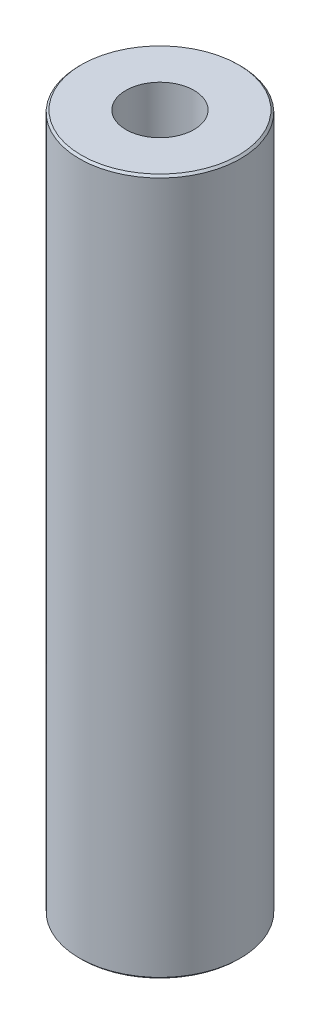
ISO-10303-21;
HEADER;
FILE_DESCRIPTION(('STEP AP214'),'2;1');
FILE_NAME('part.step','',(''),(''),'','','');
FILE_SCHEMA(('AUTOMOTIVE_DESIGN { 1 0 10303 214 1 1 1 1 }'));
ENDSEC;
DATA;
#1=APPLICATION_CONTEXT('core data for automotive mechanical design processes');
#2=APPLICATION_PROTOCOL_DEFINITION('international standard','automotive_design',2000,#1);
#3=PRODUCT_CONTEXT('',#1,'mechanical');
#4=PRODUCT('Part','Part','',(#3));
#5=PRODUCT_RELATED_PRODUCT_CATEGORY('part','',(#4));
#6=PRODUCT_DEFINITION_FORMATION('','',#4);
#7=PRODUCT_DEFINITION_CONTEXT('part definition',#1,'design');
#8=PRODUCT_DEFINITION('design','',#6,#7);
#9=PRODUCT_DEFINITION_SHAPE('','',#8);
#10=(LENGTH_UNIT() NAMED_UNIT(*) SI_UNIT(.MILLI.,.METRE.));
#11=(NAMED_UNIT(*) PLANE_ANGLE_UNIT() SI_UNIT($,.RADIAN.));
#12=(NAMED_UNIT(*) SI_UNIT($,.STERADIAN.) SOLID_ANGLE_UNIT());
#13=UNCERTAINTY_MEASURE_WITH_UNIT(LENGTH_MEASURE(1.E-05),#10,'distance_accuracy_value','');
#14=(GEOMETRIC_REPRESENTATION_CONTEXT(3) GLOBAL_UNCERTAINTY_ASSIGNED_CONTEXT((#13)) GLOBAL_UNIT_ASSIGNED_CONTEXT((#10,
#11,#12)) REPRESENTATION_CONTEXT('',''));
#15=CARTESIAN_POINT('',(0.,0.,0.));
#16=DIRECTION('',(0.,0.,1.));
#17=DIRECTION('',(1.,0.,0.));
#18=AXIS2_PLACEMENT_3D('',#15,#16,#17);
#19=CARTESIAN_POINT('',(0.,454.009973873022,0.));
#20=DIRECTION('',(0.,-1.,0.));
#21=DIRECTION('',(0.,0.,-1.));
#22=AXIS2_PLACEMENT_3D('',#19,#20,#21);
#23=CYLINDRICAL_SURFACE('',#22,52.5);
#24=CARTESIAN_POINT('',(0.,452.687352338189,0.));
#25=DIRECTION('',(0.,1.,0.));
#26=DIRECTION('',(0.,0.,1.));
#27=AXIS2_PLACEMENT_3D('',#24,#25,#26);
#28=CIRCLE('',#27,52.5);
#29=CARTESIAN_POINT('',(0.,452.687352338189,52.5));
#30=VERTEX_POINT('',#29);
#31=EDGE_CURVE('E50',#30,#30,#28,.F.);
#32=ORIENTED_EDGE('',*,*,#31,.T.);
#33=EDGE_LOOP('',(#32));
#34=FACE_BOUND('',#33,.T.);
#35=CARTESIAN_POINT('',(0.,1.32262153483309,0.));
#36=DIRECTION('',(0.,1.,0.));
#37=DIRECTION('',(0.,0.,1.));
#38=AXIS2_PLACEMENT_3D('',#35,#36,#37);
#39=CIRCLE('',#38,52.5);
#40=CARTESIAN_POINT('',(0.,1.32262153483309,52.5));
#41=VERTEX_POINT('',#40);
#42=EDGE_CURVE('E51',#41,#41,#39,.T.);
#43=ORIENTED_EDGE('',*,*,#42,.T.);
#44=EDGE_LOOP('',(#43));
#45=FACE_BOUND('',#44,.T.);
#46=ADVANCED_FACE('F39',(#34,#45),#23,.T.);
#47=CARTESIAN_POINT('',(0.,454.009973873022,0.));
#48=DIRECTION('',(0.,1.,0.));
#49=DIRECTION('',(0.,0.,1.));
#50=AXIS2_PLACEMENT_3D('',#47,#48,#49);
#51=PLANE('',#50);
#52=CARTESIAN_POINT('',(0.,454.009973873022,0.));
#53=DIRECTION('',(0.,1.,0.));
#54=DIRECTION('',(0.,0.,1.));
#55=AXIS2_PLACEMENT_3D('',#52,#53,#54);
#56=CIRCLE('',#55,51.1773784651669);
#57=CARTESIAN_POINT('',(0.,454.009973873022,51.1773784651669));
#58=VERTEX_POINT('',#57);
#59=EDGE_CURVE('E54',#58,#58,#56,.T.);
#60=ORIENTED_EDGE('',*,*,#59,.T.);
#61=EDGE_LOOP('',(#60));
#62=FACE_BOUND('',#61,.T.);
#63=CARTESIAN_POINT('',(0.,454.009973873022,0.));
#64=DIRECTION('',(0.,1.,0.));
#65=DIRECTION('',(0.,0.,1.));
#66=AXIS2_PLACEMENT_3D('',#63,#64,#65);
#67=CIRCLE('',#66,22.2014656765028);
#68=CARTESIAN_POINT('',(0.,454.009973873022,22.2014656765028));
#69=VERTEX_POINT('',#68);
#70=EDGE_CURVE('E58',#69,#69,#67,.T.);
#71=ORIENTED_EDGE('',*,*,#70,.F.);
#72=EDGE_LOOP('',(#71));
#73=FACE_BOUND('',#72,.T.);
#74=ADVANCED_FACE('F69',(#62,#73),#51,.T.);
#75=CARTESIAN_POINT('',(0.,0.,0.));
#76=DIRECTION('',(0.,1.,0.));
#77=DIRECTION('',(0.,0.,1.));
#78=AXIS2_PLACEMENT_3D('',#75,#76,#77);
#79=PLANE('',#78);
#80=CARTESIAN_POINT('',(0.,0.,0.));
#81=DIRECTION('',(0.,1.,0.));
#82=DIRECTION('',(0.,0.,1.));
#83=AXIS2_PLACEMENT_3D('',#80,#81,#82);
#84=CIRCLE('',#83,51.177378465167);
#85=CARTESIAN_POINT('',(0.,0.,51.177378465167));
#86=VERTEX_POINT('',#85);
#87=EDGE_CURVE('E10',#86,#86,#84,.F.);
#88=ORIENTED_EDGE('',*,*,#87,.T.);
#89=EDGE_LOOP('',(#88));
#90=FACE_BOUND('',#89,.T.);
#91=CARTESIAN_POINT('',(0.,0.,0.));
#92=DIRECTION('',(0.,1.,0.));
#93=DIRECTION('',(0.,0.,1.));
#94=AXIS2_PLACEMENT_3D('',#91,#92,#93);
#95=CIRCLE('',#94,22.2014656765028);
#96=CARTESIAN_POINT('',(0.,0.,22.2014656765028));
#97=VERTEX_POINT('',#96);
#98=EDGE_CURVE('E63',#97,#97,#95,.T.);
#99=ORIENTED_EDGE('',*,*,#98,.T.);
#100=EDGE_LOOP('',(#99));
#101=FACE_BOUND('',#100,.T.);
#102=ADVANCED_FACE('F75',(#90,#101),#79,.F.);
#103=CARTESIAN_POINT('',(0.,454.009973873022,0.));
#104=DIRECTION('',(0.,-1.,0.));
#105=DIRECTION('',(0.,0.,-1.));
#106=AXIS2_PLACEMENT_3D('',#103,#104,#105);
#107=CYLINDRICAL_SURFACE('',#106,22.2014656765028);
#108=ORIENTED_EDGE('',*,*,#70,.T.);
#109=EDGE_LOOP('',(#108));
#110=FACE_BOUND('',#109,.T.);
#111=ORIENTED_EDGE('',*,*,#98,.F.);
#112=EDGE_LOOP('',(#111));
#113=FACE_BOUND('',#112,.T.);
#114=ADVANCED_FACE('F70',(#110,#113),#107,.F.);
#115=CARTESIAN_POINT('',(0.,454.009973873022,0.));
#116=DIRECTION('',(0.,-1.,0.));
#117=DIRECTION('',(0.,0.,-1.));
#118=AXIS2_PLACEMENT_3D('',#115,#116,#117);
#119=CONICAL_SURFACE('',#118,51.1773784651669,0.785398163397409);
#120=ORIENTED_EDGE('',*,*,#31,.F.);
#121=EDGE_LOOP('',(#120));
#122=FACE_BOUND('',#121,.T.);
#123=ORIENTED_EDGE('',*,*,#59,.F.);
#124=EDGE_LOOP('',(#123));
#125=FACE_BOUND('',#124,.T.);
#126=ADVANCED_FACE('F81',(#122,#125),#119,.T.);
#127=CARTESIAN_POINT('',(0.,1.32262153483309,0.));
#128=DIRECTION('',(0.,1.,0.));
#129=DIRECTION('',(0.,0.,1.));
#130=AXIS2_PLACEMENT_3D('',#127,#128,#129);
#131=CONICAL_SURFACE('',#130,52.5,0.78539816339743);
#132=ORIENTED_EDGE('',*,*,#87,.F.);
#133=EDGE_LOOP('',(#132));
#134=FACE_BOUND('',#133,.T.);
#135=ORIENTED_EDGE('',*,*,#42,.F.);
#136=EDGE_LOOP('',(#135));
#137=FACE_BOUND('',#136,.T.);
#138=ADVANCED_FACE('F45',(#134,#137),#131,.T.);
#139=CLOSED_SHELL('',(#46,#74,#102,#114,#126,#138));
#140=MANIFOLD_SOLID_BREP('B2',#139);
#141=ADVANCED_BREP_SHAPE_REPRESENTATION('',(#18,#140),#14);
#142=SHAPE_DEFINITION_REPRESENTATION(#9,#141);
ENDSEC;
END-ISO-10303-21;
